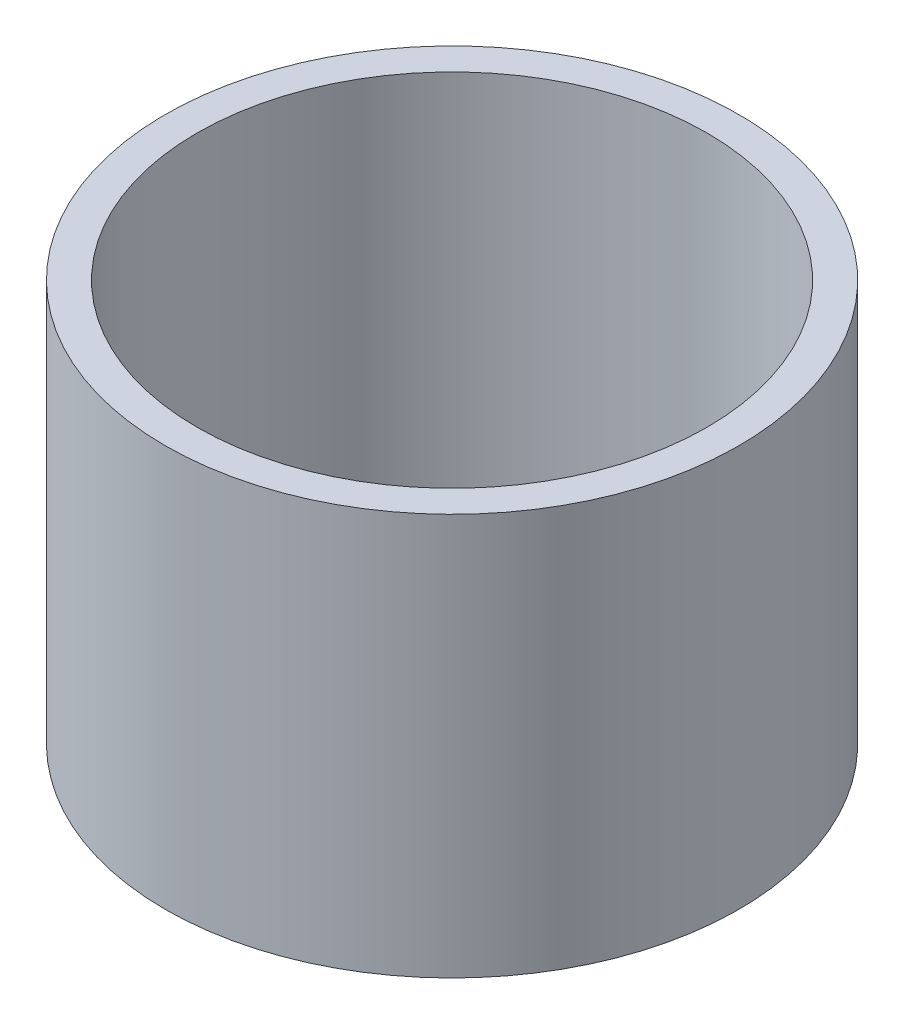
ISO-10303-21;
HEADER;
FILE_DESCRIPTION(('STEP AP214'),'2;1');
FILE_NAME('part.step','',(''),(''),'','','');
FILE_SCHEMA(('AUTOMOTIVE_DESIGN { 1 0 10303 214 1 1 1 1 }'));
ENDSEC;
DATA;
#1=APPLICATION_CONTEXT('core data for automotive mechanical design processes');
#2=APPLICATION_PROTOCOL_DEFINITION('international standard','automotive_design',2000,#1);
#3=PRODUCT_CONTEXT('',#1,'mechanical');
#4=PRODUCT('Part','Part','',(#3));
#5=PRODUCT_RELATED_PRODUCT_CATEGORY('part','',(#4));
#6=PRODUCT_DEFINITION_FORMATION('','',#4);
#7=PRODUCT_DEFINITION_CONTEXT('part definition',#1,'design');
#8=PRODUCT_DEFINITION('design','',#6,#7);
#9=PRODUCT_DEFINITION_SHAPE('','',#8);
#10=(LENGTH_UNIT() NAMED_UNIT(*) SI_UNIT(.MILLI.,.METRE.));
#11=(NAMED_UNIT(*) PLANE_ANGLE_UNIT() SI_UNIT($,.RADIAN.));
#12=(NAMED_UNIT(*) SI_UNIT($,.STERADIAN.) SOLID_ANGLE_UNIT());
#13=UNCERTAINTY_MEASURE_WITH_UNIT(LENGTH_MEASURE(1.E-05),#10,'distance_accuracy_value','');
#14=(GEOMETRIC_REPRESENTATION_CONTEXT(3) GLOBAL_UNCERTAINTY_ASSIGNED_CONTEXT((#13)) GLOBAL_UNIT_ASSIGNED_CONTEXT((#10,
#11,#12)) REPRESENTATION_CONTEXT('',''));
#15=CARTESIAN_POINT('',(0.,0.,0.));
#16=DIRECTION('',(0.,0.,1.));
#17=DIRECTION('',(1.,0.,0.));
#18=AXIS2_PLACEMENT_3D('',#15,#16,#17);
#19=CARTESIAN_POINT('',(0.,12.6,0.));
#20=DIRECTION('',(0.,1.,0.));
#21=DIRECTION('',(0.,0.,1.));
#22=AXIS2_PLACEMENT_3D('',#19,#20,#21);
#23=PLANE('',#22);
#24=CARTESIAN_POINT('',(0.,12.6,0.));
#25=DIRECTION('',(0.,1.,0.));
#26=DIRECTION('',(0.,0.,1.));
#27=AXIS2_PLACEMENT_3D('',#24,#25,#26);
#28=CIRCLE('',#27,9.);
#29=CARTESIAN_POINT('',(0.,12.6,9.));
#30=VERTEX_POINT('',#29);
#31=EDGE_CURVE('E10',#30,#30,#28,.T.);
#32=ORIENTED_EDGE('',*,*,#31,.T.);
#33=EDGE_LOOP('',(#32));
#34=FACE_BOUND('',#33,.T.);
#35=CARTESIAN_POINT('',(0.,12.6,0.));
#36=DIRECTION('',(0.,1.,0.));
#37=DIRECTION('',(0.,0.,1.));
#38=AXIS2_PLACEMENT_3D('',#35,#36,#37);
#39=CIRCLE('',#38,8.);
#40=CARTESIAN_POINT('',(0.,12.6,8.));
#41=VERTEX_POINT('',#40);
#42=EDGE_CURVE('E46',#41,#41,#39,.T.);
#43=ORIENTED_EDGE('',*,*,#42,.F.);
#44=EDGE_LOOP('',(#43));
#45=FACE_BOUND('',#44,.T.);
#46=ADVANCED_FACE('F35',(#34,#45),#23,.T.);
#47=CARTESIAN_POINT('',(0.,0.,0.));
#48=DIRECTION('',(0.,1.,0.));
#49=DIRECTION('',(0.,0.,1.));
#50=AXIS2_PLACEMENT_3D('',#47,#48,#49);
#51=PLANE('',#50);
#52=CARTESIAN_POINT('',(0.,0.,0.));
#53=DIRECTION('',(0.,1.,0.));
#54=DIRECTION('',(0.,0.,1.));
#55=AXIS2_PLACEMENT_3D('',#52,#53,#54);
#56=CIRCLE('',#55,9.);
#57=CARTESIAN_POINT('',(0.,0.,9.));
#58=VERTEX_POINT('',#57);
#59=EDGE_CURVE('E39',#58,#58,#56,.T.);
#60=ORIENTED_EDGE('',*,*,#59,.F.);
#61=EDGE_LOOP('',(#60));
#62=FACE_BOUND('',#61,.T.);
#63=CARTESIAN_POINT('',(0.,0.,0.));
#64=DIRECTION('',(0.,1.,0.));
#65=DIRECTION('',(0.,0.,1.));
#66=AXIS2_PLACEMENT_3D('',#63,#64,#65);
#67=CIRCLE('',#66,8.);
#68=CARTESIAN_POINT('',(0.,0.,8.));
#69=VERTEX_POINT('',#68);
#70=EDGE_CURVE('E48',#69,#69,#67,.T.);
#71=ORIENTED_EDGE('',*,*,#70,.T.);
#72=EDGE_LOOP('',(#71));
#73=FACE_BOUND('',#72,.T.);
#74=ADVANCED_FACE('F58',(#62,#73),#51,.F.);
#75=CARTESIAN_POINT('',(0.,12.6,0.));
#76=DIRECTION('',(0.,-1.,0.));
#77=DIRECTION('',(0.,0.,-1.));
#78=AXIS2_PLACEMENT_3D('',#75,#76,#77);
#79=CYLINDRICAL_SURFACE('',#78,9.);
#80=ORIENTED_EDGE('',*,*,#31,.F.);
#81=EDGE_LOOP('',(#80));
#82=FACE_BOUND('',#81,.T.);
#83=ORIENTED_EDGE('',*,*,#59,.T.);
#84=EDGE_LOOP('',(#83));
#85=FACE_BOUND('',#84,.T.);
#86=ADVANCED_FACE('F37',(#82,#85),#79,.T.);
#87=CARTESIAN_POINT('',(0.,12.6,0.));
#88=DIRECTION('',(0.,-1.,0.));
#89=DIRECTION('',(0.,0.,-1.));
#90=AXIS2_PLACEMENT_3D('',#87,#88,#89);
#91=CYLINDRICAL_SURFACE('',#90,8.);
#92=ORIENTED_EDGE('',*,*,#42,.T.);
#93=EDGE_LOOP('',(#92));
#94=FACE_BOUND('',#93,.T.);
#95=ORIENTED_EDGE('',*,*,#70,.F.);
#96=EDGE_LOOP('',(#95));
#97=FACE_BOUND('',#96,.T.);
#98=ADVANCED_FACE('F54',(#94,#97),#91,.F.);
#99=CLOSED_SHELL('',(#46,#74,#86,#98));
#100=MANIFOLD_SOLID_BREP('B2',#99);
#101=ADVANCED_BREP_SHAPE_REPRESENTATION('',(#18,#100),#14);
#102=SHAPE_DEFINITION_REPRESENTATION(#9,#101);
ENDSEC;
END-ISO-10303-21;
